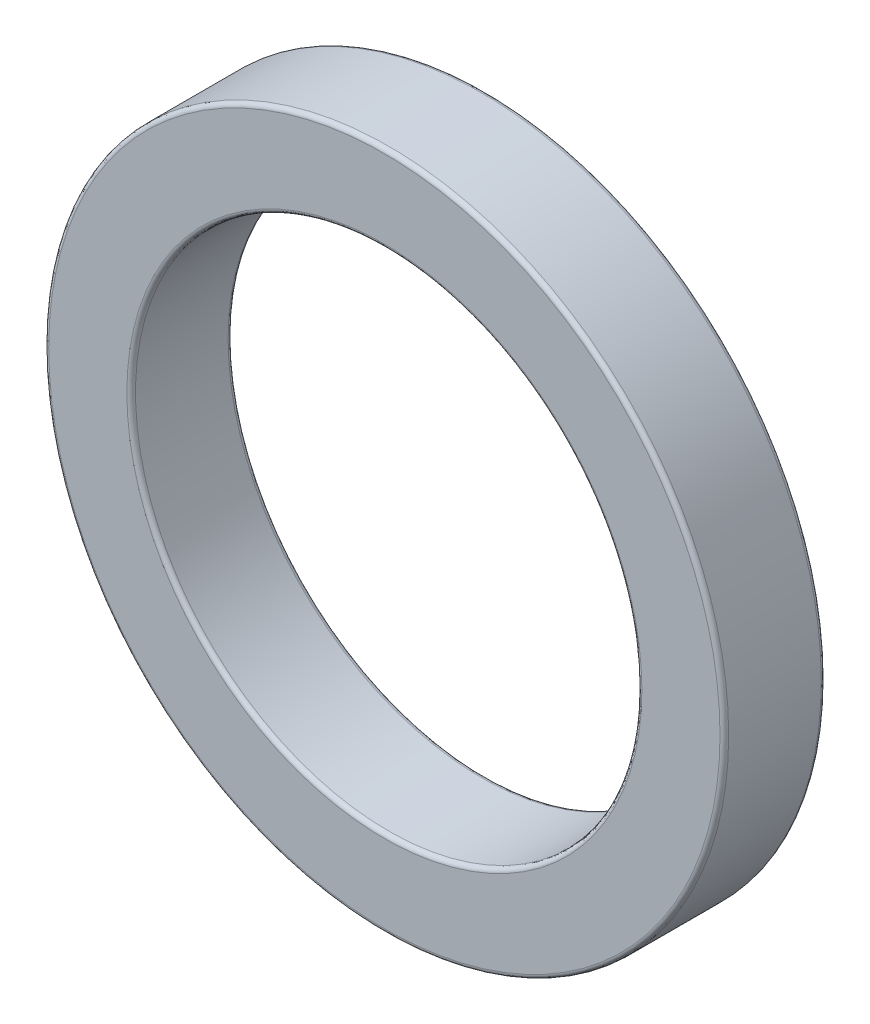
ISO-10303-21;
HEADER;
FILE_DESCRIPTION(('STEP AP214'),'2;1');
FILE_NAME('part.step','',(''),(''),'','','');
FILE_SCHEMA(('AUTOMOTIVE_DESIGN { 1 0 10303 214 1 1 1 1 }'));
ENDSEC;
DATA;
#1=APPLICATION_CONTEXT('core data for automotive mechanical design processes');
#2=APPLICATION_PROTOCOL_DEFINITION('international standard','automotive_design',2000,#1);
#3=PRODUCT_CONTEXT('',#1,'mechanical');
#4=PRODUCT('Part','Part','',(#3));
#5=PRODUCT_RELATED_PRODUCT_CATEGORY('part','',(#4));
#6=PRODUCT_DEFINITION_FORMATION('','',#4);
#7=PRODUCT_DEFINITION_CONTEXT('part definition',#1,'design');
#8=PRODUCT_DEFINITION('design','',#6,#7);
#9=PRODUCT_DEFINITION_SHAPE('','',#8);
#10=(LENGTH_UNIT() NAMED_UNIT(*) SI_UNIT(.MILLI.,.METRE.));
#11=(NAMED_UNIT(*) PLANE_ANGLE_UNIT() SI_UNIT($,.RADIAN.));
#12=(NAMED_UNIT(*) SI_UNIT($,.STERADIAN.) SOLID_ANGLE_UNIT());
#13=UNCERTAINTY_MEASURE_WITH_UNIT(LENGTH_MEASURE(1.E-05),#10,'distance_accuracy_value','');
#14=(GEOMETRIC_REPRESENTATION_CONTEXT(3) GLOBAL_UNCERTAINTY_ASSIGNED_CONTEXT((#13)) GLOBAL_UNIT_ASSIGNED_CONTEXT((#10,
#11,#12)) REPRESENTATION_CONTEXT('',''));
#15=CARTESIAN_POINT('',(0.,0.,0.));
#16=DIRECTION('',(0.,0.,1.));
#17=DIRECTION('',(1.,0.,0.));
#18=AXIS2_PLACEMENT_3D('',#15,#16,#17);
#19=CARTESIAN_POINT('',(23.5,0.,0.300000000000002));
#20=CARTESIAN_POINT('',(23.5,0.,0.12426406871193));
#21=CARTESIAN_POINT('',(23.3757359312881,0.,0.));
#22=CARTESIAN_POINT('',(23.2,0.,0.));
#23=(BOUNDED_CURVE() B_SPLINE_CURVE(3,(#19,#20,#21,#22),.UNSPECIFIED.,.F.,
.F.) B_SPLINE_CURVE_WITH_KNOTS((4,4),(0.,1.),
.UNSPECIFIED.) CURVE() GEOMETRIC_REPRESENTATION_ITEM() RATIONAL_B_SPLINE_CURVE((1.,
0.804737854124365,0.804737854124365,1.)) REPRESENTATION_ITEM(''));
#24=CARTESIAN_POINT('',(0.,0.,0.3));
#25=DIRECTION('',(0.,0.,1.));
#26=AXIS1_PLACEMENT('',#24,#25);
#27=SURFACE_OF_REVOLUTION('',#23,#26);
#28=CARTESIAN_POINT('',(0.,0.,0.3));
#29=DIRECTION('',(0.,0.,-1.));
#30=DIRECTION('',(-1.,0.,0.));
#31=AXIS2_PLACEMENT_3D('',#28,#29,#30);
#32=CIRCLE('',#31,23.5);
#33=CARTESIAN_POINT('',(-23.5,0.,0.3));
#34=VERTEX_POINT('',#33);
#35=EDGE_CURVE('E67',#34,#34,#32,.F.);
#36=ORIENTED_EDGE('',*,*,#35,.F.);
#37=EDGE_LOOP('',(#36));
#38=FACE_BOUND('',#37,.T.);
#39=CARTESIAN_POINT('',(0.,0.,0.));
#40=DIRECTION('',(0.,0.,1.));
#41=DIRECTION('',(1.,0.,0.));
#42=AXIS2_PLACEMENT_3D('',#39,#40,#41);
#43=CIRCLE('',#42,23.2);
#44=CARTESIAN_POINT('',(-23.2,0.,0.));
#45=VERTEX_POINT('',#44);
#46=CARTESIAN_POINT('',(23.2,0.,0.));
#47=VERTEX_POINT('',#46);
#48=EDGE_CURVE('E59',#45,#47,#43,.F.);
#49=ORIENTED_EDGE('',*,*,#48,.F.);
#50=CARTESIAN_POINT('',(0.,0.,0.));
#51=DIRECTION('',(0.,0.,1.));
#52=DIRECTION('',(-1.,0.,0.));
#53=AXIS2_PLACEMENT_3D('',#50,#51,#52);
#54=CIRCLE('',#53,23.2);
#55=EDGE_CURVE('E57',#47,#45,#54,.F.);
#56=ORIENTED_EDGE('',*,*,#55,.F.);
#57=EDGE_LOOP('',(#49,#56));
#58=FACE_BOUND('',#57,.T.);
#59=ADVANCED_FACE('F16',(#38,#58),#27,.F.);
#60=CARTESIAN_POINT('',(0.,0.,0.3));
#61=DIRECTION('',(0.,0.,-1.));
#62=DIRECTION('',(-1.,0.,0.));
#63=AXIS2_PLACEMENT_3D('',#60,#61,#62);
#64=CYLINDRICAL_SURFACE('',#63,23.5);
#65=CARTESIAN_POINT('',(0.,0.,6.7));
#66=DIRECTION('',(0.,0.,1.));
#67=DIRECTION('',(1.,0.,0.));
#68=AXIS2_PLACEMENT_3D('',#65,#66,#67);
#69=CIRCLE('',#68,23.5);
#70=CARTESIAN_POINT('',(23.5,0.,6.7));
#71=VERTEX_POINT('',#70);
#72=EDGE_CURVE('E297',#71,#71,#69,.T.);
#73=ORIENTED_EDGE('',*,*,#72,.F.);
#74=EDGE_LOOP('',(#73));
#75=FACE_BOUND('',#74,.T.);
#76=ORIENTED_EDGE('',*,*,#35,.T.);
#77=EDGE_LOOP('',(#76));
#78=FACE_BOUND('',#77,.T.);
#79=ADVANCED_FACE('F86',(#75,#78),#64,.T.);
#80=CARTESIAN_POINT('',(0.,0.,0.));
#81=DIRECTION('',(0.,0.,1.));
#82=DIRECTION('',(1.,0.,0.));
#83=AXIS2_PLACEMENT_3D('',#80,#81,#82);
#84=PLANE('',#83);
#85=CARTESIAN_POINT('',(0.,0.,0.));
#86=DIRECTION('',(0.,0.,-1.));
#87=DIRECTION('',(-1.,0.,0.));
#88=AXIS2_PLACEMENT_3D('',#85,#86,#87);
#89=CIRCLE('',#88,17.8);
#90=CARTESIAN_POINT('',(-17.8,0.,0.));
#91=VERTEX_POINT('',#90);
#92=CARTESIAN_POINT('',(17.8,0.,0.));
#93=VERTEX_POINT('',#92);
#94=EDGE_CURVE('E119',#91,#93,#89,.T.);
#95=ORIENTED_EDGE('',*,*,#94,.F.);
#96=CARTESIAN_POINT('',(0.,0.,0.));
#97=DIRECTION('',(0.,0.,-1.));
#98=DIRECTION('',(1.,0.,0.));
#99=AXIS2_PLACEMENT_3D('',#96,#97,#98);
#100=CIRCLE('',#99,17.8);
#101=EDGE_CURVE('E63',#91,#93,#100,.F.);
#102=ORIENTED_EDGE('',*,*,#101,.T.);
#103=EDGE_LOOP('',(#95,#102));
#104=FACE_BOUND('',#103,.T.);
#105=ORIENTED_EDGE('',*,*,#55,.T.);
#106=ORIENTED_EDGE('',*,*,#48,.T.);
#107=EDGE_LOOP('',(#105,#106));
#108=FACE_BOUND('',#107,.T.);
#109=ADVANCED_FACE('F66',(#104,#108),#84,.F.);
#110=CARTESIAN_POINT('',(23.2,0.,7.));
#111=CARTESIAN_POINT('',(23.3757359312881,0.,7.));
#112=CARTESIAN_POINT('',(23.5,0.,6.87573593128807));
#113=CARTESIAN_POINT('',(23.5,0.,6.7));
#114=(BOUNDED_CURVE() B_SPLINE_CURVE(3,(#110,#111,#112,#113),.UNSPECIFIED.,.F.,
.F.) B_SPLINE_CURVE_WITH_KNOTS((4,4),(0.,1.),
.UNSPECIFIED.) CURVE() GEOMETRIC_REPRESENTATION_ITEM() RATIONAL_B_SPLINE_CURVE((1.,
0.804737854124365,0.804737854124365,1.)) REPRESENTATION_ITEM(''));
#115=CARTESIAN_POINT('',(0.,0.,6.7));
#116=DIRECTION('',(0.,0.,1.));
#117=AXIS1_PLACEMENT('',#115,#116);
#118=SURFACE_OF_REVOLUTION('',#114,#117);
#119=ORIENTED_EDGE('',*,*,#72,.T.);
#120=EDGE_LOOP('',(#119));
#121=FACE_BOUND('',#120,.T.);
#122=CARTESIAN_POINT('',(0.,0.,7.));
#123=DIRECTION('',(0.,0.,-1.));
#124=DIRECTION('',(1.,0.,0.));
#125=AXIS2_PLACEMENT_3D('',#122,#123,#124);
#126=CIRCLE('',#125,23.2);
#127=CARTESIAN_POINT('',(-23.2,0.,7.));
#128=VERTEX_POINT('',#127);
#129=CARTESIAN_POINT('',(23.2,0.,7.));
#130=VERTEX_POINT('',#129);
#131=EDGE_CURVE('E157',#128,#130,#126,.F.);
#132=ORIENTED_EDGE('',*,*,#131,.F.);
#133=CARTESIAN_POINT('',(0.,0.,7.));
#134=DIRECTION('',(0.,0.,-1.));
#135=DIRECTION('',(-1.,0.,0.));
#136=AXIS2_PLACEMENT_3D('',#133,#134,#135);
#137=CIRCLE('',#136,23.2);
#138=EDGE_CURVE('E159',#130,#128,#137,.F.);
#139=ORIENTED_EDGE('',*,*,#138,.F.);
#140=EDGE_LOOP('',(#132,#139));
#141=FACE_BOUND('',#140,.T.);
#142=ADVANCED_FACE('F85',(#121,#141),#118,.F.);
#143=CARTESIAN_POINT('',(17.8,0.,0.));
#144=CARTESIAN_POINT('',(17.6242640687119,0.,0.));
#145=CARTESIAN_POINT('',(17.5,0.,0.124264068711925));
#146=CARTESIAN_POINT('',(17.5,0.,0.299999999999997));
#147=(BOUNDED_CURVE() B_SPLINE_CURVE(3,(#143,#144,#145,#146),.UNSPECIFIED.,.F.,
.F.) B_SPLINE_CURVE_WITH_KNOTS((4,4),(0.,1.),
.UNSPECIFIED.) CURVE() GEOMETRIC_REPRESENTATION_ITEM() RATIONAL_B_SPLINE_CURVE((1.,
0.804737854124365,0.804737854124365,1.)) REPRESENTATION_ITEM(''));
#148=CARTESIAN_POINT('',(0.,0.,0.3));
#149=DIRECTION('',(0.,0.,1.));
#150=AXIS1_PLACEMENT('',#148,#149);
#151=SURFACE_OF_REVOLUTION('',#147,#150);
#152=CARTESIAN_POINT('',(0.,0.,0.3));
#153=DIRECTION('',(0.,0.,-1.));
#154=DIRECTION('',(-1.,0.,0.));
#155=AXIS2_PLACEMENT_3D('',#152,#153,#154);
#156=CIRCLE('',#155,17.5);
#157=CARTESIAN_POINT('',(-17.5,0.,0.3));
#158=VERTEX_POINT('',#157);
#159=EDGE_CURVE('E205',#158,#158,#156,.T.);
#160=ORIENTED_EDGE('',*,*,#159,.F.);
#161=EDGE_LOOP('',(#160));
#162=FACE_BOUND('',#161,.T.);
#163=ORIENTED_EDGE('',*,*,#94,.T.);
#164=ORIENTED_EDGE('',*,*,#101,.F.);
#165=EDGE_LOOP('',(#163,#164));
#166=FACE_BOUND('',#165,.T.);
#167=ADVANCED_FACE('F123',(#162,#166),#151,.F.);
#168=CARTESIAN_POINT('',(0.,0.,7.));
#169=DIRECTION('',(0.,0.,1.));
#170=DIRECTION('',(1.,0.,0.));
#171=AXIS2_PLACEMENT_3D('',#168,#169,#170);
#172=PLANE('',#171);
#173=CARTESIAN_POINT('',(0.,0.,7.));
#174=DIRECTION('',(0.,0.,1.));
#175=DIRECTION('',(-1.,0.,0.));
#176=AXIS2_PLACEMENT_3D('',#173,#174,#175);
#177=CIRCLE('',#176,17.8);
#178=CARTESIAN_POINT('',(17.8,0.,7.));
#179=VERTEX_POINT('',#178);
#180=CARTESIAN_POINT('',(-17.8,0.,7.));
#181=VERTEX_POINT('',#180);
#182=EDGE_CURVE('E36',#179,#181,#177,.F.);
#183=ORIENTED_EDGE('',*,*,#182,.T.);
#184=CARTESIAN_POINT('',(0.,0.,7.));
#185=DIRECTION('',(0.,0.,1.));
#186=DIRECTION('',(1.,0.,0.));
#187=AXIS2_PLACEMENT_3D('',#184,#185,#186);
#188=CIRCLE('',#187,17.8);
#189=EDGE_CURVE('E28',#179,#181,#188,.T.);
#190=ORIENTED_EDGE('',*,*,#189,.F.);
#191=EDGE_LOOP('',(#183,#190));
#192=FACE_BOUND('',#191,.T.);
#193=ORIENTED_EDGE('',*,*,#138,.T.);
#194=ORIENTED_EDGE('',*,*,#131,.T.);
#195=EDGE_LOOP('',(#193,#194));
#196=FACE_BOUND('',#195,.T.);
#197=ADVANCED_FACE('F133',(#192,#196),#172,.T.);
#198=CARTESIAN_POINT('',(0.,0.,6.7));
#199=DIRECTION('',(0.,0.,-1.));
#200=DIRECTION('',(0.,1.,0.));
#201=AXIS2_PLACEMENT_3D('',#198,#199,#200);
#202=CYLINDRICAL_SURFACE('',#201,17.5);
#203=CARTESIAN_POINT('',(0.,0.,6.70000000000001));
#204=DIRECTION('',(0.,0.,1.));
#205=DIRECTION('',(1.,0.,0.));
#206=AXIS2_PLACEMENT_3D('',#203,#204,#205);
#207=CIRCLE('',#206,17.5);
#208=CARTESIAN_POINT('',(17.5,0.,6.70000000000001));
#209=VERTEX_POINT('',#208);
#210=EDGE_CURVE('E11',#209,#209,#207,.F.);
#211=ORIENTED_EDGE('',*,*,#210,.F.);
#212=EDGE_LOOP('',(#211));
#213=FACE_BOUND('',#212,.T.);
#214=ORIENTED_EDGE('',*,*,#159,.T.);
#215=EDGE_LOOP('',(#214));
#216=FACE_BOUND('',#215,.T.);
#217=ADVANCED_FACE('F225',(#213,#216),#202,.F.);
#218=CARTESIAN_POINT('',(17.5,0.,6.70000000000001));
#219=CARTESIAN_POINT('',(17.5,0.,6.87573593128808));
#220=CARTESIAN_POINT('',(17.6242640687119,0.,7.));
#221=CARTESIAN_POINT('',(17.8,0.,7.));
#222=(BOUNDED_CURVE() B_SPLINE_CURVE(3,(#218,#219,#220,#221),.UNSPECIFIED.,.F.,
.F.) B_SPLINE_CURVE_WITH_KNOTS((4,4),(0.,1.),
.UNSPECIFIED.) CURVE() GEOMETRIC_REPRESENTATION_ITEM() RATIONAL_B_SPLINE_CURVE((1.,
0.804737854124367,0.804737854124367,1.)) REPRESENTATION_ITEM(''));
#223=CARTESIAN_POINT('',(0.,0.,6.7));
#224=DIRECTION('',(0.,0.,1.));
#225=AXIS1_PLACEMENT('',#223,#224);
#226=SURFACE_OF_REVOLUTION('',#222,#225);
#227=ORIENTED_EDGE('',*,*,#189,.T.);
#228=ORIENTED_EDGE('',*,*,#182,.F.);
#229=EDGE_LOOP('',(#227,#228));
#230=FACE_BOUND('',#229,.T.);
#231=ORIENTED_EDGE('',*,*,#210,.T.);
#232=EDGE_LOOP('',(#231));
#233=FACE_BOUND('',#232,.T.);
#234=ADVANCED_FACE('F202',(#230,#233),#226,.F.);
#235=CLOSED_SHELL('',(#59,#79,#109,#142,#167,#197,#217,#234));
#236=MANIFOLD_SOLID_BREP('B1',#235);
#237=ADVANCED_BREP_SHAPE_REPRESENTATION('',(#18,#236),#14);
#238=SHAPE_DEFINITION_REPRESENTATION(#9,#237);
ENDSEC;
END-ISO-10303-21;
